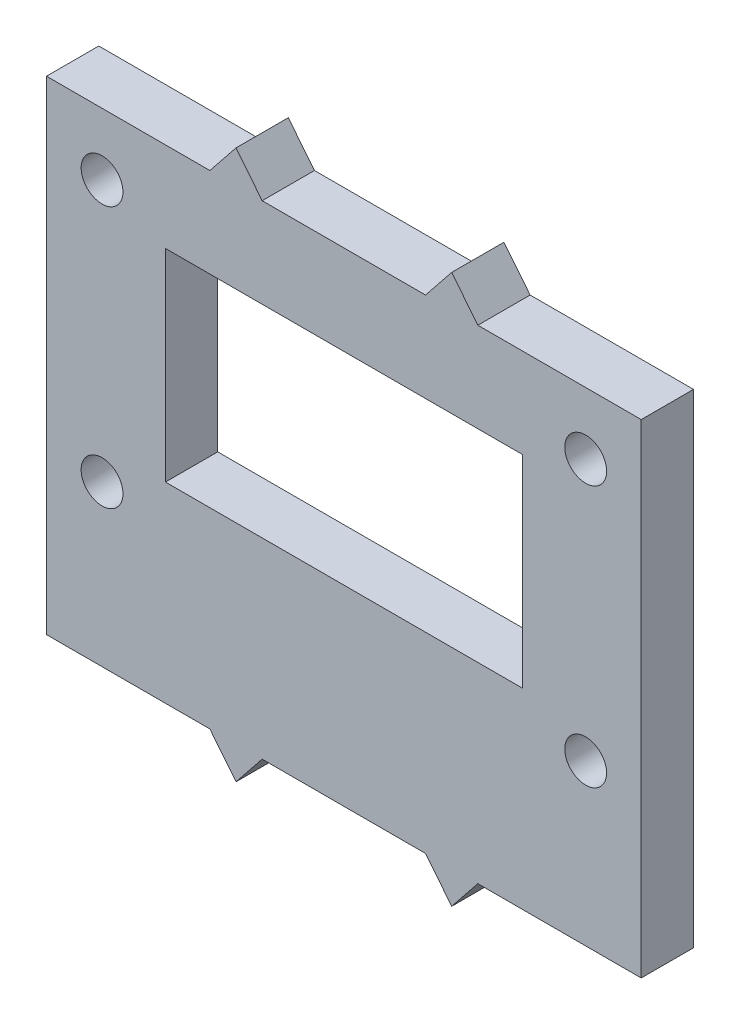
ISO-10303-21;
HEADER;
FILE_DESCRIPTION(('STEP AP214'),'2;1');
FILE_NAME('part.step','',(''),(''),'','','');
FILE_SCHEMA(('AUTOMOTIVE_DESIGN { 1 0 10303 214 1 1 1 1 }'));
ENDSEC;
DATA;
#1=APPLICATION_CONTEXT('core data for automotive mechanical design processes');
#2=APPLICATION_PROTOCOL_DEFINITION('international standard','automotive_design',2000,#1);
#3=PRODUCT_CONTEXT('',#1,'mechanical');
#4=PRODUCT('Part','Part','',(#3));
#5=PRODUCT_RELATED_PRODUCT_CATEGORY('part','',(#4));
#6=PRODUCT_DEFINITION_FORMATION('','',#4);
#7=PRODUCT_DEFINITION_CONTEXT('part definition',#1,'design');
#8=PRODUCT_DEFINITION('design','',#6,#7);
#9=PRODUCT_DEFINITION_SHAPE('','',#8);
#10=(LENGTH_UNIT() NAMED_UNIT(*) SI_UNIT(.MILLI.,.METRE.));
#11=(NAMED_UNIT(*) PLANE_ANGLE_UNIT() SI_UNIT($,.RADIAN.));
#12=(NAMED_UNIT(*) SI_UNIT($,.STERADIAN.) SOLID_ANGLE_UNIT());
#13=UNCERTAINTY_MEASURE_WITH_UNIT(LENGTH_MEASURE(1.E-05),#10,'distance_accuracy_value','');
#14=(GEOMETRIC_REPRESENTATION_CONTEXT(3) GLOBAL_UNCERTAINTY_ASSIGNED_CONTEXT((#13)) GLOBAL_UNIT_ASSIGNED_CONTEXT((#10,
#11,#12)) REPRESENTATION_CONTEXT('',''));
#15=CARTESIAN_POINT('',(0.,0.,0.));
#16=DIRECTION('',(0.,0.,1.));
#17=DIRECTION('',(1.,0.,0.));
#18=AXIS2_PLACEMENT_3D('',#15,#16,#17);
#19=CARTESIAN_POINT('',(0.,0.,4.));
#20=DIRECTION('',(0.,0.,1.));
#21=DIRECTION('',(1.,0.,0.));
#22=AXIS2_PLACEMENT_3D('',#19,#20,#21);
#23=PLANE('',#22);
#24=CARTESIAN_POINT('',(41.25,12.2525920824197,4.));
#25=DIRECTION('',(0.,0.,-1.));
#26=DIRECTION('',(-1.,0.,0.));
#27=AXIS2_PLACEMENT_3D('',#24,#25,#26);
#28=CIRCLE('',#27,1.6);
#29=CARTESIAN_POINT('',(39.65,12.2525920824197,4.));
#30=VERTEX_POINT('',#29);
#31=EDGE_CURVE('E568',#30,#30,#28,.T.);
#32=ORIENTED_EDGE('',*,*,#31,.T.);
#33=EDGE_LOOP('',(#32));
#34=FACE_BOUND('',#33,.T.);
#35=CARTESIAN_POINT('',(4.25,12.2525920824197,4.));
#36=DIRECTION('',(0.,0.,-1.));
#37=DIRECTION('',(-1.,0.,0.));
#38=AXIS2_PLACEMENT_3D('',#35,#36,#37);
#39=CIRCLE('',#38,1.6);
#40=CARTESIAN_POINT('',(2.65,12.2525920824197,4.));
#41=VERTEX_POINT('',#40);
#42=EDGE_CURVE('E591',#41,#41,#39,.T.);
#43=ORIENTED_EDGE('',*,*,#42,.T.);
#44=EDGE_LOOP('',(#43));
#45=FACE_BOUND('',#44,.T.);
#46=CARTESIAN_POINT('',(4.25,32.2525920824197,4.));
#47=DIRECTION('',(0.,0.,-1.));
#48=DIRECTION('',(-1.,0.,0.));
#49=AXIS2_PLACEMENT_3D('',#46,#47,#48);
#50=CIRCLE('',#49,1.6);
#51=CARTESIAN_POINT('',(2.65,32.2525920824197,4.));
#52=VERTEX_POINT('',#51);
#53=EDGE_CURVE('E582',#52,#52,#50,.T.);
#54=ORIENTED_EDGE('',*,*,#53,.T.);
#55=EDGE_LOOP('',(#54));
#56=FACE_BOUND('',#55,.T.);
#57=CARTESIAN_POINT('',(41.25,32.2525920824197,4.));
#58=DIRECTION('',(0.,0.,-1.));
#59=DIRECTION('',(-1.,0.,0.));
#60=AXIS2_PLACEMENT_3D('',#57,#58,#59);
#61=CIRCLE('',#60,1.6);
#62=CARTESIAN_POINT('',(39.65,32.2525920824197,4.));
#63=VERTEX_POINT('',#62);
#64=EDGE_CURVE('E577',#63,#63,#61,.T.);
#65=ORIENTED_EDGE('',*,*,#64,.T.);
#66=EDGE_LOOP('',(#65));
#67=FACE_BOUND('',#66,.T.);
#68=DIRECTION('',(1.,0.,0.));
#69=VECTOR('',#68,1.);
#70=CARTESIAN_POINT('',(0.,0.,4.));
#71=LINE('',#70,#69);
#72=CARTESIAN_POINT('',(0.,0.,4.));
#73=VERTEX_POINT('',#72);
#74=CARTESIAN_POINT('',(12.5,0.,4.));
#75=VERTEX_POINT('',#74);
#76=EDGE_CURVE('E202',#73,#75,#71,.T.);
#77=ORIENTED_EDGE('',*,*,#76,.T.);
#78=DIRECTION('',(0.624695047554424,-0.78086880944303,0.));
#79=VECTOR('',#78,1.);
#80=CARTESIAN_POINT('',(7.6219512195122,6.09756097560976,4.));
#81=LINE('',#80,#79);
#82=CARTESIAN_POINT('',(14.5,-2.5,4.));
#83=VERTEX_POINT('',#82);
#84=EDGE_CURVE('E205',#75,#83,#81,.T.);
#85=ORIENTED_EDGE('',*,*,#84,.T.);
#86=DIRECTION('',(0.624695047554424,0.780868809443031,0.));
#87=VECTOR('',#86,1.);
#88=CARTESIAN_POINT('',(10.0609756097561,-8.04878048780488,4.));
#89=LINE('',#88,#87);
#90=CARTESIAN_POINT('',(16.5,0.,4.));
#91=VERTEX_POINT('',#90);
#92=EDGE_CURVE('E210',#83,#91,#89,.T.);
#93=ORIENTED_EDGE('',*,*,#92,.T.);
#94=CARTESIAN_POINT('',(29.,0.,4.));
#95=VERTEX_POINT('',#94);
#96=EDGE_CURVE('E208',#91,#95,#71,.T.);
#97=ORIENTED_EDGE('',*,*,#96,.T.);
#98=DIRECTION('',(-0.624695047554424,0.78086880944303,0.));
#99=VECTOR('',#98,1.);
#100=CARTESIAN_POINT('',(17.6829268292683,14.1463414634146,4.));
#101=LINE('',#100,#99);
#102=CARTESIAN_POINT('',(31.,-2.5,4.));
#103=VERTEX_POINT('',#102);
#104=EDGE_CURVE('E212',#103,#95,#101,.T.);
#105=ORIENTED_EDGE('',*,*,#104,.F.);
#106=DIRECTION('',(-0.624695047554424,-0.78086880944303,0.));
#107=VECTOR('',#106,1.);
#108=CARTESIAN_POINT('',(20.1219512195122,-16.0975609756098,4.));
#109=LINE('',#108,#107);
#110=CARTESIAN_POINT('',(33.,0.,4.));
#111=VERTEX_POINT('',#110);
#112=EDGE_CURVE('E215',#111,#103,#109,.T.);
#113=ORIENTED_EDGE('',*,*,#112,.F.);
#114=CARTESIAN_POINT('',(45.5,0.,4.));
#115=VERTEX_POINT('',#114);
#116=EDGE_CURVE('E207',#111,#115,#71,.T.);
#117=ORIENTED_EDGE('',*,*,#116,.T.);
#118=DIRECTION('',(0.,1.,0.));
#119=VECTOR('',#118,1.);
#120=CARTESIAN_POINT('',(45.5,0.,4.));
#121=LINE('',#120,#119);
#122=CARTESIAN_POINT('',(45.5,37.,4.));
#123=VERTEX_POINT('',#122);
#124=EDGE_CURVE('E218',#115,#123,#121,.T.);
#125=ORIENTED_EDGE('',*,*,#124,.T.);
#126=DIRECTION('',(1.,0.,0.));
#127=VECTOR('',#126,1.);
#128=CARTESIAN_POINT('',(0.,37.,4.));
#129=LINE('',#128,#127);
#130=CARTESIAN_POINT('',(33.,37.,4.));
#131=VERTEX_POINT('',#130);
#132=EDGE_CURVE('E220',#131,#123,#129,.T.);
#133=ORIENTED_EDGE('',*,*,#132,.F.);
#134=DIRECTION('',(-0.624695047554424,0.78086880944303,0.));
#135=VECTOR('',#134,1.);
#136=CARTESIAN_POINT('',(38.1707317073171,30.5365853658537,4.));
#137=LINE('',#136,#135);
#138=CARTESIAN_POINT('',(31.,39.5,4.));
#139=VERTEX_POINT('',#138);
#140=EDGE_CURVE('E223',#131,#139,#137,.T.);
#141=ORIENTED_EDGE('',*,*,#140,.T.);
#142=DIRECTION('',(-0.624695047554424,-0.78086880944303,0.));
#143=VECTOR('',#142,1.);
#144=CARTESIAN_POINT('',(-0.365853658536584,0.292682926829267,4.));
#145=LINE('',#144,#143);
#146=CARTESIAN_POINT('',(29.,37.,4.));
#147=VERTEX_POINT('',#146);
#148=EDGE_CURVE('E227',#139,#147,#145,.T.);
#149=ORIENTED_EDGE('',*,*,#148,.T.);
#150=CARTESIAN_POINT('',(16.5,37.,4.));
#151=VERTEX_POINT('',#150);
#152=EDGE_CURVE('E225',#151,#147,#129,.T.);
#153=ORIENTED_EDGE('',*,*,#152,.F.);
#154=DIRECTION('',(0.624695047554424,-0.78086880944303,0.));
#155=VECTOR('',#154,1.);
#156=CARTESIAN_POINT('',(28.109756097561,22.4878048780488,4.));
#157=LINE('',#156,#155);
#158=CARTESIAN_POINT('',(14.5,39.5,4.));
#159=VERTEX_POINT('',#158);
#160=EDGE_CURVE('E229',#159,#151,#157,.T.);
#161=ORIENTED_EDGE('',*,*,#160,.F.);
#162=DIRECTION('',(0.624695047554424,0.780868809443031,0.));
#163=VECTOR('',#162,1.);
#164=CARTESIAN_POINT('',(-10.4268292682927,8.34146341463413,4.));
#165=LINE('',#164,#163);
#166=CARTESIAN_POINT('',(12.5,37.,4.));
#167=VERTEX_POINT('',#166);
#168=EDGE_CURVE('E232',#167,#159,#165,.T.);
#169=ORIENTED_EDGE('',*,*,#168,.F.);
#170=CARTESIAN_POINT('',(0.,37.,4.));
#171=VERTEX_POINT('',#170);
#172=EDGE_CURVE('E224',#171,#167,#129,.T.);
#173=ORIENTED_EDGE('',*,*,#172,.F.);
#174=DIRECTION('',(0.,1.,0.));
#175=VECTOR('',#174,1.);
#176=CARTESIAN_POINT('',(0.,0.,4.));
#177=LINE('',#176,#175);
#178=EDGE_CURVE('E235',#73,#171,#177,.T.);
#179=ORIENTED_EDGE('',*,*,#178,.F.);
#180=EDGE_LOOP('',(#77,#85,#93,#97,#105,#113,#117,#125,#133,#141,#149,#153,#161,#169,#173,#179));
#181=FACE_BOUND('',#180,.T.);
#182=DIRECTION('',(1.,0.,0.));
#183=VECTOR('',#182,1.);
#184=CARTESIAN_POINT('',(0.,30.14,4.));
#185=LINE('',#184,#183);
#186=CARTESIAN_POINT('',(9.1,30.14,4.));
#187=VERTEX_POINT('',#186);
#188=CARTESIAN_POINT('',(36.4,30.14,4.));
#189=VERTEX_POINT('',#188);
#190=EDGE_CURVE('E187',#187,#189,#185,.T.);
#191=ORIENTED_EDGE('',*,*,#190,.T.);
#192=DIRECTION('',(0.,-1.,0.));
#193=VECTOR('',#192,1.);
#194=CARTESIAN_POINT('',(36.4,0.,4.));
#195=LINE('',#194,#193);
#196=CARTESIAN_POINT('',(36.4,14.6590845952906,4.));
#197=VERTEX_POINT('',#196);
#198=EDGE_CURVE('E54',#189,#197,#195,.T.);
#199=ORIENTED_EDGE('',*,*,#198,.T.);
#200=DIRECTION('',(1.,0.,0.));
#201=VECTOR('',#200,1.);
#202=CARTESIAN_POINT('',(0.,14.6590845952906,4.));
#203=LINE('',#202,#201);
#204=CARTESIAN_POINT('',(9.1,14.6590845952906,4.));
#205=VERTEX_POINT('',#204);
#206=EDGE_CURVE('E192',#205,#197,#203,.T.);
#207=ORIENTED_EDGE('',*,*,#206,.F.);
#208=DIRECTION('',(0.,-1.,0.));
#209=VECTOR('',#208,1.);
#210=CARTESIAN_POINT('',(9.1,0.,4.));
#211=LINE('',#210,#209);
#212=EDGE_CURVE('E178',#187,#205,#211,.T.);
#213=ORIENTED_EDGE('',*,*,#212,.F.);
#214=EDGE_LOOP('',(#191,#199,#207,#213));
#215=FACE_BOUND('',#214,.T.);
#216=ADVANCED_FACE('F39',(#34,#45,#56,#67,#181,#215),#23,.T.);
#217=CARTESIAN_POINT('',(0.,0.,0.));
#218=DIRECTION('',(0.,0.,1.));
#219=DIRECTION('',(1.,0.,0.));
#220=AXIS2_PLACEMENT_3D('',#217,#218,#219);
#221=PLANE('',#220);
#222=CARTESIAN_POINT('',(41.25,12.2525920824197,0.));
#223=DIRECTION('',(0.,0.,-1.));
#224=DIRECTION('',(-1.,0.,0.));
#225=AXIS2_PLACEMENT_3D('',#222,#223,#224);
#226=CIRCLE('',#225,1.6);
#227=CARTESIAN_POINT('',(39.65,12.2525920824197,0.));
#228=VERTEX_POINT('',#227);
#229=EDGE_CURVE('E571',#228,#228,#226,.T.);
#230=ORIENTED_EDGE('',*,*,#229,.F.);
#231=EDGE_LOOP('',(#230));
#232=FACE_BOUND('',#231,.T.);
#233=CARTESIAN_POINT('',(4.25,12.2525920824197,0.));
#234=DIRECTION('',(0.,0.,-1.));
#235=DIRECTION('',(-1.,0.,0.));
#236=AXIS2_PLACEMENT_3D('',#233,#234,#235);
#237=CIRCLE('',#236,1.6);
#238=CARTESIAN_POINT('',(2.65,12.2525920824197,0.));
#239=VERTEX_POINT('',#238);
#240=EDGE_CURVE('E573',#239,#239,#237,.T.);
#241=ORIENTED_EDGE('',*,*,#240,.F.);
#242=EDGE_LOOP('',(#241));
#243=FACE_BOUND('',#242,.T.);
#244=CARTESIAN_POINT('',(4.25,32.2525920824197,0.));
#245=DIRECTION('',(0.,0.,-1.));
#246=DIRECTION('',(-1.,0.,0.));
#247=AXIS2_PLACEMENT_3D('',#244,#245,#246);
#248=CIRCLE('',#247,1.6);
#249=CARTESIAN_POINT('',(2.65,32.2525920824197,0.));
#250=VERTEX_POINT('',#249);
#251=EDGE_CURVE('E586',#250,#250,#248,.T.);
#252=ORIENTED_EDGE('',*,*,#251,.F.);
#253=EDGE_LOOP('',(#252));
#254=FACE_BOUND('',#253,.T.);
#255=CARTESIAN_POINT('',(41.25,32.2525920824197,0.));
#256=DIRECTION('',(0.,0.,-1.));
#257=DIRECTION('',(-1.,0.,0.));
#258=AXIS2_PLACEMENT_3D('',#255,#256,#257);
#259=CIRCLE('',#258,1.6);
#260=CARTESIAN_POINT('',(39.65,32.2525920824197,0.));
#261=VERTEX_POINT('',#260);
#262=EDGE_CURVE('E580',#261,#261,#259,.T.);
#263=ORIENTED_EDGE('',*,*,#262,.F.);
#264=EDGE_LOOP('',(#263));
#265=FACE_BOUND('',#264,.T.);
#266=DIRECTION('',(1.,0.,0.));
#267=VECTOR('',#266,1.);
#268=CARTESIAN_POINT('',(0.,0.,0.));
#269=LINE('',#268,#267);
#270=CARTESIAN_POINT('',(0.,0.,0.));
#271=VERTEX_POINT('',#270);
#272=CARTESIAN_POINT('',(12.5,0.,0.));
#273=VERTEX_POINT('',#272);
#274=EDGE_CURVE('E199',#271,#273,#269,.T.);
#275=ORIENTED_EDGE('',*,*,#274,.F.);
#276=DIRECTION('',(0.,1.,0.));
#277=VECTOR('',#276,1.);
#278=CARTESIAN_POINT('',(0.,0.,0.));
#279=LINE('',#278,#277);
#280=CARTESIAN_POINT('',(0.,37.,0.));
#281=VERTEX_POINT('',#280);
#282=EDGE_CURVE('E206',#271,#281,#279,.T.);
#283=ORIENTED_EDGE('',*,*,#282,.T.);
#284=DIRECTION('',(1.,0.,0.));
#285=VECTOR('',#284,1.);
#286=CARTESIAN_POINT('',(0.,37.,0.));
#287=LINE('',#286,#285);
#288=CARTESIAN_POINT('',(12.5,37.,0.));
#289=VERTEX_POINT('',#288);
#290=EDGE_CURVE('E260',#281,#289,#287,.T.);
#291=ORIENTED_EDGE('',*,*,#290,.T.);
#292=DIRECTION('',(0.624695047554424,0.780868809443031,0.));
#293=VECTOR('',#292,1.);
#294=CARTESIAN_POINT('',(-10.4268292682927,8.34146341463413,0.));
#295=LINE('',#294,#293);
#296=CARTESIAN_POINT('',(14.5,39.5,0.));
#297=VERTEX_POINT('',#296);
#298=EDGE_CURVE('E269',#289,#297,#295,.T.);
#299=ORIENTED_EDGE('',*,*,#298,.T.);
#300=DIRECTION('',(0.624695047554424,-0.78086880944303,0.));
#301=VECTOR('',#300,1.);
#302=CARTESIAN_POINT('',(28.109756097561,22.4878048780488,0.));
#303=LINE('',#302,#301);
#304=CARTESIAN_POINT('',(16.5,37.,0.));
#305=VERTEX_POINT('',#304);
#306=EDGE_CURVE('E266',#297,#305,#303,.T.);
#307=ORIENTED_EDGE('',*,*,#306,.T.);
#308=CARTESIAN_POINT('',(29.,37.,0.));
#309=VERTEX_POINT('',#308);
#310=EDGE_CURVE('E261',#305,#309,#287,.T.);
#311=ORIENTED_EDGE('',*,*,#310,.T.);
#312=DIRECTION('',(-0.624695047554424,-0.78086880944303,0.));
#313=VECTOR('',#312,1.);
#314=CARTESIAN_POINT('',(-0.365853658536584,0.292682926829267,0.));
#315=LINE('',#314,#313);
#316=CARTESIAN_POINT('',(31.,39.5,0.));
#317=VERTEX_POINT('',#316);
#318=EDGE_CURVE('E263',#317,#309,#315,.T.);
#319=ORIENTED_EDGE('',*,*,#318,.F.);
#320=DIRECTION('',(-0.624695047554424,0.78086880944303,0.));
#321=VECTOR('',#320,1.);
#322=CARTESIAN_POINT('',(38.1707317073171,30.5365853658537,0.));
#323=LINE('',#322,#321);
#324=CARTESIAN_POINT('',(33.,37.,0.));
#325=VERTEX_POINT('',#324);
#326=EDGE_CURVE('E259',#325,#317,#323,.T.);
#327=ORIENTED_EDGE('',*,*,#326,.F.);
#328=CARTESIAN_POINT('',(45.5,37.,0.));
#329=VERTEX_POINT('',#328);
#330=EDGE_CURVE('E256',#325,#329,#287,.T.);
#331=ORIENTED_EDGE('',*,*,#330,.T.);
#332=DIRECTION('',(0.,1.,0.));
#333=VECTOR('',#332,1.);
#334=CARTESIAN_POINT('',(45.5,0.,0.));
#335=LINE('',#334,#333);
#336=CARTESIAN_POINT('',(45.5,0.,0.));
#337=VERTEX_POINT('',#336);
#338=EDGE_CURVE('E253',#337,#329,#335,.T.);
#339=ORIENTED_EDGE('',*,*,#338,.F.);
#340=CARTESIAN_POINT('',(33.,0.,0.));
#341=VERTEX_POINT('',#340);
#342=EDGE_CURVE('E242',#341,#337,#269,.T.);
#343=ORIENTED_EDGE('',*,*,#342,.F.);
#344=DIRECTION('',(-0.624695047554424,-0.78086880944303,0.));
#345=VECTOR('',#344,1.);
#346=CARTESIAN_POINT('',(20.1219512195122,-16.0975609756098,0.));
#347=LINE('',#346,#345);
#348=CARTESIAN_POINT('',(31.,-2.5,0.));
#349=VERTEX_POINT('',#348);
#350=EDGE_CURVE('E250',#341,#349,#347,.T.);
#351=ORIENTED_EDGE('',*,*,#350,.T.);
#352=DIRECTION('',(-0.624695047554424,0.78086880944303,0.));
#353=VECTOR('',#352,1.);
#354=CARTESIAN_POINT('',(17.6829268292683,14.1463414634146,0.));
#355=LINE('',#354,#353);
#356=CARTESIAN_POINT('',(29.,0.,0.));
#357=VERTEX_POINT('',#356);
#358=EDGE_CURVE('E247',#349,#357,#355,.T.);
#359=ORIENTED_EDGE('',*,*,#358,.T.);
#360=CARTESIAN_POINT('',(16.5,0.,0.));
#361=VERTEX_POINT('',#360);
#362=EDGE_CURVE('E243',#361,#357,#269,.T.);
#363=ORIENTED_EDGE('',*,*,#362,.F.);
#364=DIRECTION('',(0.624695047554424,0.780868809443031,0.));
#365=VECTOR('',#364,1.);
#366=CARTESIAN_POINT('',(10.0609756097561,-8.04878048780488,0.));
#367=LINE('',#366,#365);
#368=CARTESIAN_POINT('',(14.5,-2.5,0.));
#369=VERTEX_POINT('',#368);
#370=EDGE_CURVE('E245',#369,#361,#367,.T.);
#371=ORIENTED_EDGE('',*,*,#370,.F.);
#372=DIRECTION('',(0.624695047554424,-0.78086880944303,0.));
#373=VECTOR('',#372,1.);
#374=CARTESIAN_POINT('',(7.6219512195122,6.09756097560976,0.));
#375=LINE('',#374,#373);
#376=EDGE_CURVE('E241',#273,#369,#375,.T.);
#377=ORIENTED_EDGE('',*,*,#376,.F.);
#378=EDGE_LOOP('',(#275,#283,#291,#299,#307,#311,#319,#327,#331,#339,#343,#351,#359,#363,#371,#377));
#379=FACE_BOUND('',#378,.T.);
#380=DIRECTION('',(0.,-1.,0.));
#381=VECTOR('',#380,1.);
#382=CARTESIAN_POINT('',(36.4,0.,0.));
#383=LINE('',#382,#381);
#384=CARTESIAN_POINT('',(36.4,30.14,0.));
#385=VERTEX_POINT('',#384);
#386=CARTESIAN_POINT('',(36.4,14.6590845952906,0.));
#387=VERTEX_POINT('',#386);
#388=EDGE_CURVE('E11',#385,#387,#383,.T.);
#389=ORIENTED_EDGE('',*,*,#388,.F.);
#390=DIRECTION('',(1.,0.,0.));
#391=VECTOR('',#390,1.);
#392=CARTESIAN_POINT('',(0.,30.14,0.));
#393=LINE('',#392,#391);
#394=CARTESIAN_POINT('',(9.1,30.14,0.));
#395=VERTEX_POINT('',#394);
#396=EDGE_CURVE('E310',#395,#385,#393,.T.);
#397=ORIENTED_EDGE('',*,*,#396,.F.);
#398=DIRECTION('',(0.,-1.,0.));
#399=VECTOR('',#398,1.);
#400=CARTESIAN_POINT('',(9.1,0.,0.));
#401=LINE('',#400,#399);
#402=CARTESIAN_POINT('',(9.1,14.6590845952906,0.));
#403=VERTEX_POINT('',#402);
#404=EDGE_CURVE('E181',#395,#403,#401,.T.);
#405=ORIENTED_EDGE('',*,*,#404,.T.);
#406=DIRECTION('',(1.,0.,0.));
#407=VECTOR('',#406,1.);
#408=CARTESIAN_POINT('',(0.,14.6590845952906,0.));
#409=LINE('',#408,#407);
#410=EDGE_CURVE('E47',#403,#387,#409,.T.);
#411=ORIENTED_EDGE('',*,*,#410,.T.);
#412=EDGE_LOOP('',(#389,#397,#405,#411));
#413=FACE_BOUND('',#412,.T.);
#414=ADVANCED_FACE('F315',(#232,#243,#254,#265,#379,#413),#221,.F.);
#415=CARTESIAN_POINT('',(0.,0.,4.));
#416=DIRECTION('',(0.,1.,0.));
#417=DIRECTION('',(0.,0.,1.));
#418=AXIS2_PLACEMENT_3D('',#415,#416,#417);
#419=PLANE('',#418);
#420=ORIENTED_EDGE('',*,*,#274,.T.);
#421=DIRECTION('',(0.,0.,-1.));
#422=VECTOR('',#421,1.);
#423=CARTESIAN_POINT('',(12.5,0.,4.));
#424=LINE('',#423,#422);
#425=EDGE_CURVE('E307',#75,#273,#424,.T.);
#426=ORIENTED_EDGE('',*,*,#425,.F.);
#427=ORIENTED_EDGE('',*,*,#76,.F.);
#428=DIRECTION('',(0.,0.,-1.));
#429=VECTOR('',#428,1.);
#430=CARTESIAN_POINT('',(0.,0.,4.));
#431=LINE('',#430,#429);
#432=EDGE_CURVE('E238',#73,#271,#431,.T.);
#433=ORIENTED_EDGE('',*,*,#432,.T.);
#434=EDGE_LOOP('',(#420,#426,#427,#433));
#435=FACE_BOUND('',#434,.T.);
#436=ADVANCED_FACE('F338',(#435),#419,.F.);
#437=CARTESIAN_POINT('',(7.6219512195122,6.09756097560976,4.));
#438=DIRECTION('',(0.78086880944303,0.624695047554424,0.));
#439=DIRECTION('',(-0.624695047554424,0.78086880944303,0.));
#440=AXIS2_PLACEMENT_3D('',#437,#438,#439);
#441=PLANE('',#440);
#442=ORIENTED_EDGE('',*,*,#376,.T.);
#443=DIRECTION('',(0.,0.,-1.));
#444=VECTOR('',#443,1.);
#445=CARTESIAN_POINT('',(14.5,-2.5,4.));
#446=LINE('',#445,#444);
#447=EDGE_CURVE('E304',#83,#369,#446,.T.);
#448=ORIENTED_EDGE('',*,*,#447,.F.);
#449=ORIENTED_EDGE('',*,*,#84,.F.);
#450=ORIENTED_EDGE('',*,*,#425,.T.);
#451=EDGE_LOOP('',(#442,#448,#449,#450));
#452=FACE_BOUND('',#451,.T.);
#453=ADVANCED_FACE('F41',(#452),#441,.F.);
#454=CARTESIAN_POINT('',(10.0609756097561,-8.04878048780488,4.));
#455=DIRECTION('',(-0.780868809443031,0.624695047554424,0.));
#456=DIRECTION('',(-0.624695047554424,-0.780868809443031,0.));
#457=AXIS2_PLACEMENT_3D('',#454,#455,#456);
#458=PLANE('',#457);
#459=ORIENTED_EDGE('',*,*,#370,.T.);
#460=DIRECTION('',(0.,0.,-1.));
#461=VECTOR('',#460,1.);
#462=CARTESIAN_POINT('',(16.5,0.,4.));
#463=LINE('',#462,#461);
#464=EDGE_CURVE('E301',#91,#361,#463,.T.);
#465=ORIENTED_EDGE('',*,*,#464,.F.);
#466=ORIENTED_EDGE('',*,*,#92,.F.);
#467=ORIENTED_EDGE('',*,*,#447,.T.);
#468=EDGE_LOOP('',(#459,#465,#466,#467));
#469=FACE_BOUND('',#468,.T.);
#470=ADVANCED_FACE('F381',(#469),#458,.F.);
#471=ORIENTED_EDGE('',*,*,#362,.T.);
#472=DIRECTION('',(0.,0.,-1.));
#473=VECTOR('',#472,1.);
#474=CARTESIAN_POINT('',(29.,0.,4.));
#475=LINE('',#474,#473);
#476=EDGE_CURVE('E299',#95,#357,#475,.T.);
#477=ORIENTED_EDGE('',*,*,#476,.F.);
#478=ORIENTED_EDGE('',*,*,#96,.F.);
#479=ORIENTED_EDGE('',*,*,#464,.T.);
#480=EDGE_LOOP('',(#471,#477,#478,#479));
#481=FACE_BOUND('',#480,.T.);
#482=ADVANCED_FACE('F374',(#481),#419,.F.);
#483=CARTESIAN_POINT('',(17.6829268292683,14.1463414634146,4.));
#484=DIRECTION('',(-0.78086880944303,-0.624695047554424,0.));
#485=DIRECTION('',(0.624695047554424,-0.78086880944303,0.));
#486=AXIS2_PLACEMENT_3D('',#483,#484,#485);
#487=PLANE('',#486);
#488=ORIENTED_EDGE('',*,*,#358,.F.);
#489=DIRECTION('',(0.,0.,-1.));
#490=VECTOR('',#489,1.);
#491=CARTESIAN_POINT('',(31.,-2.5,4.));
#492=LINE('',#491,#490);
#493=EDGE_CURVE('E297',#103,#349,#492,.T.);
#494=ORIENTED_EDGE('',*,*,#493,.F.);
#495=ORIENTED_EDGE('',*,*,#104,.T.);
#496=ORIENTED_EDGE('',*,*,#476,.T.);
#497=EDGE_LOOP('',(#488,#494,#495,#496));
#498=FACE_BOUND('',#497,.T.);
#499=ADVANCED_FACE('F377',(#498),#487,.T.);
#500=CARTESIAN_POINT('',(20.1219512195122,-16.0975609756098,4.));
#501=DIRECTION('',(0.78086880944303,-0.624695047554424,0.));
#502=DIRECTION('',(0.624695047554424,0.78086880944303,0.));
#503=AXIS2_PLACEMENT_3D('',#500,#501,#502);
#504=PLANE('',#503);
#505=ORIENTED_EDGE('',*,*,#350,.F.);
#506=DIRECTION('',(0.,0.,-1.));
#507=VECTOR('',#506,1.);
#508=CARTESIAN_POINT('',(33.,0.,4.));
#509=LINE('',#508,#507);
#510=EDGE_CURVE('E295',#111,#341,#509,.T.);
#511=ORIENTED_EDGE('',*,*,#510,.F.);
#512=ORIENTED_EDGE('',*,*,#112,.T.);
#513=ORIENTED_EDGE('',*,*,#493,.T.);
#514=EDGE_LOOP('',(#505,#511,#512,#513));
#515=FACE_BOUND('',#514,.T.);
#516=ADVANCED_FACE('F372',(#515),#504,.T.);
#517=ORIENTED_EDGE('',*,*,#342,.T.);
#518=DIRECTION('',(0.,0.,-1.));
#519=VECTOR('',#518,1.);
#520=CARTESIAN_POINT('',(45.5,0.,4.));
#521=LINE('',#520,#519);
#522=EDGE_CURVE('E292',#115,#337,#521,.T.);
#523=ORIENTED_EDGE('',*,*,#522,.F.);
#524=ORIENTED_EDGE('',*,*,#116,.F.);
#525=ORIENTED_EDGE('',*,*,#510,.T.);
#526=EDGE_LOOP('',(#517,#523,#524,#525));
#527=FACE_BOUND('',#526,.T.);
#528=ADVANCED_FACE('F368',(#527),#419,.F.);
#529=CARTESIAN_POINT('',(45.5,0.,4.));
#530=DIRECTION('',(-1.,0.,0.));
#531=DIRECTION('',(0.,0.,1.));
#532=AXIS2_PLACEMENT_3D('',#529,#530,#531);
#533=PLANE('',#532);
#534=ORIENTED_EDGE('',*,*,#338,.T.);
#535=DIRECTION('',(0.,0.,-1.));
#536=VECTOR('',#535,1.);
#537=CARTESIAN_POINT('',(45.5,37.,4.));
#538=LINE('',#537,#536);
#539=EDGE_CURVE('E290',#123,#329,#538,.T.);
#540=ORIENTED_EDGE('',*,*,#539,.F.);
#541=ORIENTED_EDGE('',*,*,#124,.F.);
#542=ORIENTED_EDGE('',*,*,#522,.T.);
#543=EDGE_LOOP('',(#534,#540,#541,#542));
#544=FACE_BOUND('',#543,.T.);
#545=ADVANCED_FACE('F365',(#544),#533,.F.);
#546=CARTESIAN_POINT('',(0.,37.,4.));
#547=DIRECTION('',(0.,1.,0.));
#548=DIRECTION('',(-1.,0.,0.));
#549=AXIS2_PLACEMENT_3D('',#546,#547,#548);
#550=PLANE('',#549);
#551=ORIENTED_EDGE('',*,*,#330,.F.);
#552=DIRECTION('',(0.,0.,-1.));
#553=VECTOR('',#552,1.);
#554=CARTESIAN_POINT('',(33.,37.,4.));
#555=LINE('',#554,#553);
#556=EDGE_CURVE('E288',#131,#325,#555,.T.);
#557=ORIENTED_EDGE('',*,*,#556,.F.);
#558=ORIENTED_EDGE('',*,*,#132,.T.);
#559=ORIENTED_EDGE('',*,*,#539,.T.);
#560=EDGE_LOOP('',(#551,#557,#558,#559));
#561=FACE_BOUND('',#560,.T.);
#562=ADVANCED_FACE('F348',(#561),#550,.T.);
#563=CARTESIAN_POINT('',(38.1707317073171,30.5365853658537,4.));
#564=DIRECTION('',(-0.78086880944303,-0.624695047554424,0.));
#565=DIRECTION('',(0.624695047554424,-0.78086880944303,0.));
#566=AXIS2_PLACEMENT_3D('',#563,#564,#565);
#567=PLANE('',#566);
#568=ORIENTED_EDGE('',*,*,#326,.T.);
#569=DIRECTION('',(0.,0.,-1.));
#570=VECTOR('',#569,1.);
#571=CARTESIAN_POINT('',(31.,39.5,4.));
#572=LINE('',#571,#570);
#573=EDGE_CURVE('E285',#139,#317,#572,.T.);
#574=ORIENTED_EDGE('',*,*,#573,.F.);
#575=ORIENTED_EDGE('',*,*,#140,.F.);
#576=ORIENTED_EDGE('',*,*,#556,.T.);
#577=EDGE_LOOP('',(#568,#574,#575,#576));
#578=FACE_BOUND('',#577,.T.);
#579=ADVANCED_FACE('F360',(#578),#567,.F.);
#580=CARTESIAN_POINT('',(-0.365853658536584,0.292682926829267,4.));
#581=DIRECTION('',(0.78086880944303,-0.624695047554424,0.));
#582=DIRECTION('',(0.624695047554424,0.78086880944303,0.));
#583=AXIS2_PLACEMENT_3D('',#580,#581,#582);
#584=PLANE('',#583);
#585=ORIENTED_EDGE('',*,*,#318,.T.);
#586=DIRECTION('',(0.,0.,-1.));
#587=VECTOR('',#586,1.);
#588=CARTESIAN_POINT('',(29.,37.,4.));
#589=LINE('',#588,#587);
#590=EDGE_CURVE('E283',#147,#309,#589,.T.);
#591=ORIENTED_EDGE('',*,*,#590,.F.);
#592=ORIENTED_EDGE('',*,*,#148,.F.);
#593=ORIENTED_EDGE('',*,*,#573,.T.);
#594=EDGE_LOOP('',(#585,#591,#592,#593));
#595=FACE_BOUND('',#594,.T.);
#596=ADVANCED_FACE('F357',(#595),#584,.F.);
#597=ORIENTED_EDGE('',*,*,#310,.F.);
#598=DIRECTION('',(0.,0.,-1.));
#599=VECTOR('',#598,1.);
#600=CARTESIAN_POINT('',(16.5,37.,4.));
#601=LINE('',#600,#599);
#602=EDGE_CURVE('E281',#151,#305,#601,.T.);
#603=ORIENTED_EDGE('',*,*,#602,.F.);
#604=ORIENTED_EDGE('',*,*,#152,.T.);
#605=ORIENTED_EDGE('',*,*,#590,.T.);
#606=EDGE_LOOP('',(#597,#603,#604,#605));
#607=FACE_BOUND('',#606,.T.);
#608=ADVANCED_FACE('F349',(#607),#550,.T.);
#609=CARTESIAN_POINT('',(28.109756097561,22.4878048780488,4.));
#610=DIRECTION('',(0.78086880944303,0.624695047554424,0.));
#611=DIRECTION('',(-0.624695047554424,0.78086880944303,0.));
#612=AXIS2_PLACEMENT_3D('',#609,#610,#611);
#613=PLANE('',#612);
#614=ORIENTED_EDGE('',*,*,#306,.F.);
#615=DIRECTION('',(0.,0.,-1.));
#616=VECTOR('',#615,1.);
#617=CARTESIAN_POINT('',(14.5,39.5,4.));
#618=LINE('',#617,#616);
#619=EDGE_CURVE('E279',#159,#297,#618,.T.);
#620=ORIENTED_EDGE('',*,*,#619,.F.);
#621=ORIENTED_EDGE('',*,*,#160,.T.);
#622=ORIENTED_EDGE('',*,*,#602,.T.);
#623=EDGE_LOOP('',(#614,#620,#621,#622));
#624=FACE_BOUND('',#623,.T.);
#625=ADVANCED_FACE('F352',(#624),#613,.T.);
#626=CARTESIAN_POINT('',(-10.4268292682927,8.34146341463413,4.));
#627=DIRECTION('',(-0.780868809443031,0.624695047554424,0.));
#628=DIRECTION('',(-0.624695047554424,-0.780868809443031,0.));
#629=AXIS2_PLACEMENT_3D('',#626,#627,#628);
#630=PLANE('',#629);
#631=ORIENTED_EDGE('',*,*,#298,.F.);
#632=DIRECTION('',(0.,0.,-1.));
#633=VECTOR('',#632,1.);
#634=CARTESIAN_POINT('',(12.5,37.,4.));
#635=LINE('',#634,#633);
#636=EDGE_CURVE('E277',#167,#289,#635,.T.);
#637=ORIENTED_EDGE('',*,*,#636,.F.);
#638=ORIENTED_EDGE('',*,*,#168,.T.);
#639=ORIENTED_EDGE('',*,*,#619,.T.);
#640=EDGE_LOOP('',(#631,#637,#638,#639));
#641=FACE_BOUND('',#640,.T.);
#642=ADVANCED_FACE('F346',(#641),#630,.T.);
#643=ORIENTED_EDGE('',*,*,#290,.F.);
#644=DIRECTION('',(0.,0.,-1.));
#645=VECTOR('',#644,1.);
#646=CARTESIAN_POINT('',(0.,37.,4.));
#647=LINE('',#646,#645);
#648=EDGE_CURVE('E275',#171,#281,#647,.T.);
#649=ORIENTED_EDGE('',*,*,#648,.F.);
#650=ORIENTED_EDGE('',*,*,#172,.T.);
#651=ORIENTED_EDGE('',*,*,#636,.T.);
#652=EDGE_LOOP('',(#643,#649,#650,#651));
#653=FACE_BOUND('',#652,.T.);
#654=ADVANCED_FACE('F328',(#653),#550,.T.);
#655=CARTESIAN_POINT('',(0.,0.,4.));
#656=DIRECTION('',(-1.,0.,0.));
#657=DIRECTION('',(0.,0.,1.));
#658=AXIS2_PLACEMENT_3D('',#655,#656,#657);
#659=PLANE('',#658);
#660=ORIENTED_EDGE('',*,*,#282,.F.);
#661=ORIENTED_EDGE('',*,*,#432,.F.);
#662=ORIENTED_EDGE('',*,*,#178,.T.);
#663=ORIENTED_EDGE('',*,*,#648,.T.);
#664=EDGE_LOOP('',(#660,#661,#662,#663));
#665=FACE_BOUND('',#664,.T.);
#666=ADVANCED_FACE('F321',(#665),#659,.T.);
#667=CARTESIAN_POINT('',(36.4,0.,-6.04));
#668=DIRECTION('',(-1.,0.,0.));
#669=DIRECTION('',(0.,0.,1.));
#670=AXIS2_PLACEMENT_3D('',#667,#668,#669);
#671=PLANE('',#670);
#672=ORIENTED_EDGE('',*,*,#388,.T.);
#673=DIRECTION('',(0.,0.,1.));
#674=VECTOR('',#673,1.);
#675=CARTESIAN_POINT('',(36.4,14.6590845952906,-6.04));
#676=LINE('',#675,#674);
#677=EDGE_CURVE('E197',#387,#197,#676,.T.);
#678=ORIENTED_EDGE('',*,*,#677,.T.);
#679=ORIENTED_EDGE('',*,*,#198,.F.);
#680=DIRECTION('',(0.,0.,1.));
#681=VECTOR('',#680,1.);
#682=CARTESIAN_POINT('',(36.4,30.14,-6.04));
#683=LINE('',#682,#681);
#684=EDGE_CURVE('E184',#385,#189,#683,.T.);
#685=ORIENTED_EDGE('',*,*,#684,.F.);
#686=EDGE_LOOP('',(#672,#678,#679,#685));
#687=FACE_BOUND('',#686,.T.);
#688=ADVANCED_FACE('F319',(#687),#671,.T.);
#689=CARTESIAN_POINT('',(0.,14.6590845952906,-6.04));
#690=DIRECTION('',(0.,-1.,0.));
#691=DIRECTION('',(0.,0.,-1.));
#692=AXIS2_PLACEMENT_3D('',#689,#690,#691);
#693=PLANE('',#692);
#694=DIRECTION('',(0.,0.,1.));
#695=VECTOR('',#694,1.);
#696=CARTESIAN_POINT('',(9.1,14.6590845952906,-6.04));
#697=LINE('',#696,#695);
#698=EDGE_CURVE('E183',#403,#205,#697,.T.);
#699=ORIENTED_EDGE('',*,*,#698,.T.);
#700=ORIENTED_EDGE('',*,*,#206,.T.);
#701=ORIENTED_EDGE('',*,*,#677,.F.);
#702=ORIENTED_EDGE('',*,*,#410,.F.);
#703=EDGE_LOOP('',(#699,#700,#701,#702));
#704=FACE_BOUND('',#703,.T.);
#705=ADVANCED_FACE('F318',(#704),#693,.F.);
#706=CARTESIAN_POINT('',(9.1,0.,-6.04));
#707=DIRECTION('',(-1.,0.,0.));
#708=DIRECTION('',(0.,0.,1.));
#709=AXIS2_PLACEMENT_3D('',#706,#707,#708);
#710=PLANE('',#709);
#711=DIRECTION('',(0.,0.,1.));
#712=VECTOR('',#711,1.);
#713=CARTESIAN_POINT('',(9.1,30.14,-6.04));
#714=LINE('',#713,#712);
#715=EDGE_CURVE('E62',#395,#187,#714,.T.);
#716=ORIENTED_EDGE('',*,*,#715,.T.);
#717=ORIENTED_EDGE('',*,*,#212,.T.);
#718=ORIENTED_EDGE('',*,*,#698,.F.);
#719=ORIENTED_EDGE('',*,*,#404,.F.);
#720=EDGE_LOOP('',(#716,#717,#718,#719));
#721=FACE_BOUND('',#720,.T.);
#722=ADVANCED_FACE('F175',(#721),#710,.F.);
#723=CARTESIAN_POINT('',(0.,30.14,-6.04));
#724=DIRECTION('',(0.,-1.,0.));
#725=DIRECTION('',(0.,0.,-1.));
#726=AXIS2_PLACEMENT_3D('',#723,#724,#725);
#727=PLANE('',#726);
#728=ORIENTED_EDGE('',*,*,#396,.T.);
#729=ORIENTED_EDGE('',*,*,#684,.T.);
#730=ORIENTED_EDGE('',*,*,#190,.F.);
#731=ORIENTED_EDGE('',*,*,#715,.F.);
#732=EDGE_LOOP('',(#728,#729,#730,#731));
#733=FACE_BOUND('',#732,.T.);
#734=ADVANCED_FACE('F188',(#733),#727,.T.);
#735=CARTESIAN_POINT('',(41.25,32.2525920824197,4.));
#736=DIRECTION('',(0.,0.,-1.));
#737=DIRECTION('',(-1.,0.,0.));
#738=AXIS2_PLACEMENT_3D('',#735,#736,#737);
#739=CYLINDRICAL_SURFACE('',#738,1.6);
#740=ORIENTED_EDGE('',*,*,#64,.F.);
#741=EDGE_LOOP('',(#740));
#742=FACE_BOUND('',#741,.T.);
#743=ORIENTED_EDGE('',*,*,#262,.T.);
#744=EDGE_LOOP('',(#743));
#745=FACE_BOUND('',#744,.T.);
#746=ADVANCED_FACE('F510',(#742,#745),#739,.F.);
#747=CARTESIAN_POINT('',(4.25,32.2525920824197,4.));
#748=DIRECTION('',(0.,0.,-1.));
#749=DIRECTION('',(-1.,0.,0.));
#750=AXIS2_PLACEMENT_3D('',#747,#748,#749);
#751=CYLINDRICAL_SURFACE('',#750,1.6);
#752=ORIENTED_EDGE('',*,*,#53,.F.);
#753=EDGE_LOOP('',(#752));
#754=FACE_BOUND('',#753,.T.);
#755=ORIENTED_EDGE('',*,*,#251,.T.);
#756=EDGE_LOOP('',(#755));
#757=FACE_BOUND('',#756,.T.);
#758=ADVANCED_FACE('F532',(#754,#757),#751,.F.);
#759=CARTESIAN_POINT('',(4.25,12.2525920824197,4.));
#760=DIRECTION('',(0.,0.,-1.));
#761=DIRECTION('',(-1.,0.,0.));
#762=AXIS2_PLACEMENT_3D('',#759,#760,#761);
#763=CYLINDRICAL_SURFACE('',#762,1.6);
#764=ORIENTED_EDGE('',*,*,#42,.F.);
#765=EDGE_LOOP('',(#764));
#766=FACE_BOUND('',#765,.T.);
#767=ORIENTED_EDGE('',*,*,#240,.T.);
#768=EDGE_LOOP('',(#767));
#769=FACE_BOUND('',#768,.T.);
#770=ADVANCED_FACE('F542',(#766,#769),#763,.F.);
#771=CARTESIAN_POINT('',(41.25,12.2525920824197,4.));
#772=DIRECTION('',(0.,0.,-1.));
#773=DIRECTION('',(-1.,0.,0.));
#774=AXIS2_PLACEMENT_3D('',#771,#772,#773);
#775=CYLINDRICAL_SURFACE('',#774,1.6);
#776=ORIENTED_EDGE('',*,*,#31,.F.);
#777=EDGE_LOOP('',(#776));
#778=FACE_BOUND('',#777,.T.);
#779=ORIENTED_EDGE('',*,*,#229,.T.);
#780=EDGE_LOOP('',(#779));
#781=FACE_BOUND('',#780,.T.);
#782=ADVANCED_FACE('F552',(#778,#781),#775,.F.);
#783=CLOSED_SHELL('',(#216,#414,#436,#453,#470,#482,#499,#516,#528,#545,#562,#579,#596,#608,
#625,#642,#654,#666,#688,#705,#722,#734,#746,#758,#770,#782));
#784=MANIFOLD_SOLID_BREP('B2',#783);
#785=ADVANCED_BREP_SHAPE_REPRESENTATION('',(#18,#784),#14);
#786=SHAPE_DEFINITION_REPRESENTATION(#9,#785);
ENDSEC;
END-ISO-10303-21;
